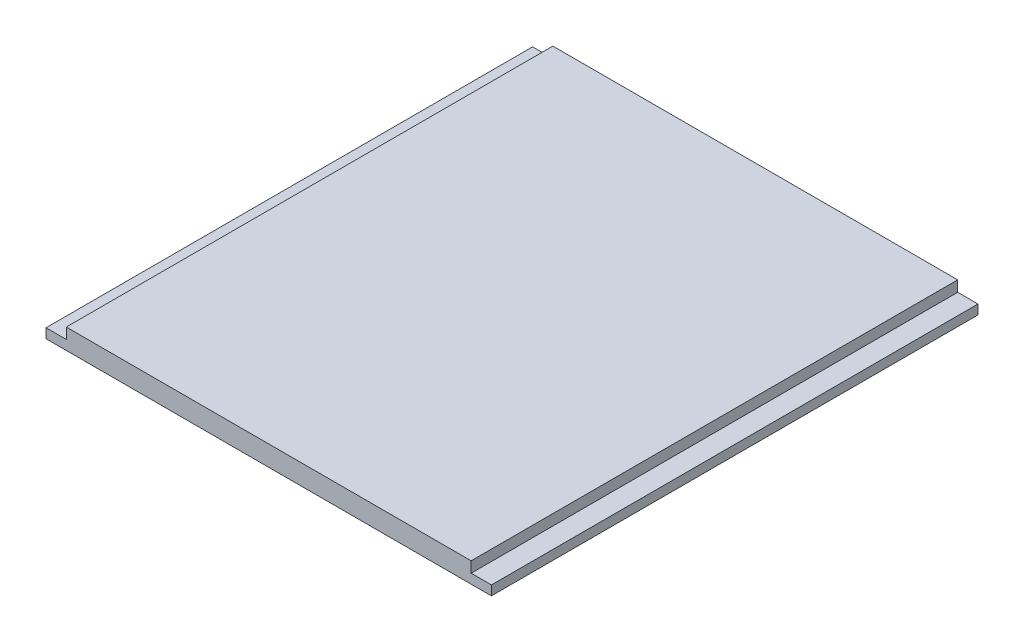
ISO-10303-21;
HEADER;
FILE_DESCRIPTION(('STEP AP214'),'2;1');
FILE_NAME('part.step','',(''),(''),'','','');
FILE_SCHEMA(('AUTOMOTIVE_DESIGN { 1 0 10303 214 1 1 1 1 }'));
ENDSEC;
DATA;
#1=APPLICATION_CONTEXT('core data for automotive mechanical design processes');
#2=APPLICATION_PROTOCOL_DEFINITION('international standard','automotive_design',2000,#1);
#3=PRODUCT_CONTEXT('',#1,'mechanical');
#4=PRODUCT('Part','Part','',(#3));
#5=PRODUCT_RELATED_PRODUCT_CATEGORY('part','',(#4));
#6=PRODUCT_DEFINITION_FORMATION('','',#4);
#7=PRODUCT_DEFINITION_CONTEXT('part definition',#1,'design');
#8=PRODUCT_DEFINITION('design','',#6,#7);
#9=PRODUCT_DEFINITION_SHAPE('','',#8);
#10=(LENGTH_UNIT() NAMED_UNIT(*) SI_UNIT(.MILLI.,.METRE.));
#11=(NAMED_UNIT(*) PLANE_ANGLE_UNIT() SI_UNIT($,.RADIAN.));
#12=(NAMED_UNIT(*) SI_UNIT($,.STERADIAN.) SOLID_ANGLE_UNIT());
#13=UNCERTAINTY_MEASURE_WITH_UNIT(LENGTH_MEASURE(1.E-05),#10,'distance_accuracy_value','');
#14=(GEOMETRIC_REPRESENTATION_CONTEXT(3) GLOBAL_UNCERTAINTY_ASSIGNED_CONTEXT((#13)) GLOBAL_UNIT_ASSIGNED_CONTEXT((#10,
#11,#12)) REPRESENTATION_CONTEXT('',''));
#15=CARTESIAN_POINT('',(0.,0.,0.));
#16=DIRECTION('',(0.,0.,1.));
#17=DIRECTION('',(1.,0.,0.));
#18=AXIS2_PLACEMENT_3D('',#15,#16,#17);
#19=CARTESIAN_POINT('',(0.,6.35,0.));
#20=DIRECTION('',(1.,0.,0.));
#21=DIRECTION('',(0.,0.,-1.));
#22=AXIS2_PLACEMENT_3D('',#19,#20,#21);
#23=PLANE('',#22);
#24=DIRECTION('',(0.,0.,1.));
#25=VECTOR('',#24,1.);
#26=CARTESIAN_POINT('',(0.,2.975,-152.4));
#27=LINE('',#26,#25);
#28=CARTESIAN_POINT('',(0.,2.975,-152.4));
#29=VERTEX_POINT('',#28);
#30=CARTESIAN_POINT('',(0.,2.975,0.));
#31=VERTEX_POINT('',#30);
#32=EDGE_CURVE('E97',#29,#31,#27,.T.);
#33=ORIENTED_EDGE('',*,*,#32,.F.);
#34=DIRECTION('',(0.,-1.,0.));
#35=VECTOR('',#34,1.);
#36=CARTESIAN_POINT('',(0.,6.35,-152.4));
#37=LINE('',#36,#35);
#38=CARTESIAN_POINT('',(0.,0.,-152.4));
#39=VERTEX_POINT('',#38);
#40=EDGE_CURVE('E119',#29,#39,#37,.T.);
#41=ORIENTED_EDGE('',*,*,#40,.T.);
#42=DIRECTION('',(0.,0.,1.));
#43=VECTOR('',#42,1.);
#44=CARTESIAN_POINT('',(0.,0.,0.));
#45=LINE('',#44,#43);
#46=CARTESIAN_POINT('',(0.,0.,0.));
#47=VERTEX_POINT('',#46);
#48=EDGE_CURVE('E118',#39,#47,#45,.T.);
#49=ORIENTED_EDGE('',*,*,#48,.T.);
#50=DIRECTION('',(0.,-1.,0.));
#51=VECTOR('',#50,1.);
#52=CARTESIAN_POINT('',(0.,6.35,0.));
#53=LINE('',#52,#51);
#54=EDGE_CURVE('E11',#31,#47,#53,.T.);
#55=ORIENTED_EDGE('',*,*,#54,.F.);
#56=EDGE_LOOP('',(#33,#41,#49,#55));
#57=FACE_BOUND('',#56,.T.);
#58=ADVANCED_FACE('F34',(#57),#23,.F.);
#59=CARTESIAN_POINT('',(0.,6.35,0.));
#60=DIRECTION('',(0.,0.,-1.));
#61=DIRECTION('',(-1.,0.,0.));
#62=AXIS2_PLACEMENT_3D('',#59,#60,#61);
#63=PLANE('',#62);
#64=DIRECTION('',(1.,0.,0.));
#65=VECTOR('',#64,1.);
#66=CARTESIAN_POINT('',(0.,6.35,0.));
#67=LINE('',#66,#65);
#68=CARTESIAN_POINT('',(6.35000000000002,6.35,0.));
#69=VERTEX_POINT('',#68);
#70=CARTESIAN_POINT('',(133.15,6.35,0.));
#71=VERTEX_POINT('',#70);
#72=EDGE_CURVE('E138',#69,#71,#67,.T.);
#73=ORIENTED_EDGE('',*,*,#72,.F.);
#74=DIRECTION('',(0.,1.,0.));
#75=VECTOR('',#74,1.);
#76=CARTESIAN_POINT('',(6.35000000000002,2.975,0.));
#77=LINE('',#76,#75);
#78=CARTESIAN_POINT('',(6.35000000000002,2.975,0.));
#79=VERTEX_POINT('',#78);
#80=EDGE_CURVE('E56',#79,#69,#77,.T.);
#81=ORIENTED_EDGE('',*,*,#80,.F.);
#82=DIRECTION('',(1.,0.,0.));
#83=VECTOR('',#82,1.);
#84=CARTESIAN_POINT('',(0.,2.975,0.));
#85=LINE('',#84,#83);
#86=EDGE_CURVE('E101',#31,#79,#85,.T.);
#87=ORIENTED_EDGE('',*,*,#86,.F.);
#88=ORIENTED_EDGE('',*,*,#54,.T.);
#89=DIRECTION('',(1.,0.,0.));
#90=VECTOR('',#89,1.);
#91=CARTESIAN_POINT('',(0.,0.,0.));
#92=LINE('',#91,#90);
#93=CARTESIAN_POINT('',(139.5,0.,0.));
#94=VERTEX_POINT('',#93);
#95=EDGE_CURVE('E123',#47,#94,#92,.T.);
#96=ORIENTED_EDGE('',*,*,#95,.T.);
#97=DIRECTION('',(0.,-1.,0.));
#98=VECTOR('',#97,1.);
#99=CARTESIAN_POINT('',(139.5,6.35,0.));
#100=LINE('',#99,#98);
#101=CARTESIAN_POINT('',(139.5,2.975,0.));
#102=VERTEX_POINT('',#101);
#103=EDGE_CURVE('E41',#102,#94,#100,.T.);
#104=ORIENTED_EDGE('',*,*,#103,.F.);
#105=DIRECTION('',(1.,0.,0.));
#106=VECTOR('',#105,1.);
#107=CARTESIAN_POINT('',(139.5,2.975,0.));
#108=LINE('',#107,#106);
#109=CARTESIAN_POINT('',(133.15,2.975,0.));
#110=VERTEX_POINT('',#109);
#111=EDGE_CURVE('E160',#110,#102,#108,.T.);
#112=ORIENTED_EDGE('',*,*,#111,.F.);
#113=DIRECTION('',(0.,1.,0.));
#114=VECTOR('',#113,1.);
#115=CARTESIAN_POINT('',(133.15,2.975,0.));
#116=LINE('',#115,#114);
#117=EDGE_CURVE('E168',#110,#71,#116,.T.);
#118=ORIENTED_EDGE('',*,*,#117,.T.);
#119=EDGE_LOOP('',(#73,#81,#87,#88,#96,#104,#112,#118));
#120=FACE_BOUND('',#119,.T.);
#121=ADVANCED_FACE('F111',(#120),#63,.F.);
#122=CARTESIAN_POINT('',(139.5,6.35,0.));
#123=DIRECTION('',(-1.,0.,0.));
#124=DIRECTION('',(0.,0.,1.));
#125=AXIS2_PLACEMENT_3D('',#122,#123,#124);
#126=PLANE('',#125);
#127=DIRECTION('',(0.,-1.,0.));
#128=VECTOR('',#127,1.);
#129=CARTESIAN_POINT('',(139.5,6.35,-152.4));
#130=LINE('',#129,#128);
#131=CARTESIAN_POINT('',(139.5,2.975,-152.4));
#132=VERTEX_POINT('',#131);
#133=CARTESIAN_POINT('',(139.5,0.,-152.4));
#134=VERTEX_POINT('',#133);
#135=EDGE_CURVE('E140',#132,#134,#130,.T.);
#136=ORIENTED_EDGE('',*,*,#135,.F.);
#137=DIRECTION('',(0.,0.,-1.));
#138=VECTOR('',#137,1.);
#139=CARTESIAN_POINT('',(139.5,2.975,-152.4));
#140=LINE('',#139,#138);
#141=EDGE_CURVE('E147',#102,#132,#140,.T.);
#142=ORIENTED_EDGE('',*,*,#141,.F.);
#143=ORIENTED_EDGE('',*,*,#103,.T.);
#144=DIRECTION('',(0.,0.,-1.));
#145=VECTOR('',#144,1.);
#146=CARTESIAN_POINT('',(139.5,0.,0.));
#147=LINE('',#146,#145);
#148=EDGE_CURVE('E126',#94,#134,#147,.T.);
#149=ORIENTED_EDGE('',*,*,#148,.T.);
#150=EDGE_LOOP('',(#136,#142,#143,#149));
#151=FACE_BOUND('',#150,.T.);
#152=ADVANCED_FACE('F145',(#151),#126,.F.);
#153=CARTESIAN_POINT('',(0.,6.35,-152.4));
#154=DIRECTION('',(0.,0.,1.));
#155=DIRECTION('',(1.,0.,0.));
#156=AXIS2_PLACEMENT_3D('',#153,#154,#155);
#157=PLANE('',#156);
#158=DIRECTION('',(-1.,0.,0.));
#159=VECTOR('',#158,1.);
#160=CARTESIAN_POINT('',(0.,2.975,-152.4));
#161=LINE('',#160,#159);
#162=CARTESIAN_POINT('',(6.35,2.975,-152.4));
#163=VERTEX_POINT('',#162);
#164=EDGE_CURVE('E103',#163,#29,#161,.T.);
#165=ORIENTED_EDGE('',*,*,#164,.F.);
#166=DIRECTION('',(0.,1.,0.));
#167=VECTOR('',#166,1.);
#168=CARTESIAN_POINT('',(6.35,2.975,-152.4));
#169=LINE('',#168,#167);
#170=CARTESIAN_POINT('',(6.35,6.35,-152.4));
#171=VERTEX_POINT('',#170);
#172=EDGE_CURVE('E124',#163,#171,#169,.T.);
#173=ORIENTED_EDGE('',*,*,#172,.T.);
#174=DIRECTION('',(-1.,0.,0.));
#175=VECTOR('',#174,1.);
#176=CARTESIAN_POINT('',(0.,6.35,-152.4));
#177=LINE('',#176,#175);
#178=CARTESIAN_POINT('',(133.15,6.35,-152.4));
#179=VERTEX_POINT('',#178);
#180=EDGE_CURVE('E131',#179,#171,#177,.T.);
#181=ORIENTED_EDGE('',*,*,#180,.F.);
#182=DIRECTION('',(0.,1.,0.));
#183=VECTOR('',#182,1.);
#184=CARTESIAN_POINT('',(133.15,2.975,-152.4));
#185=LINE('',#184,#183);
#186=CARTESIAN_POINT('',(133.15,2.975,-152.4));
#187=VERTEX_POINT('',#186);
#188=EDGE_CURVE('E48',#187,#179,#185,.T.);
#189=ORIENTED_EDGE('',*,*,#188,.F.);
#190=DIRECTION('',(-1.,0.,0.));
#191=VECTOR('',#190,1.);
#192=CARTESIAN_POINT('',(139.5,2.975,-152.4));
#193=LINE('',#192,#191);
#194=EDGE_CURVE('E154',#132,#187,#193,.T.);
#195=ORIENTED_EDGE('',*,*,#194,.F.);
#196=ORIENTED_EDGE('',*,*,#135,.T.);
#197=DIRECTION('',(-1.,0.,0.));
#198=VECTOR('',#197,1.);
#199=CARTESIAN_POINT('',(0.,0.,-152.4));
#200=LINE('',#199,#198);
#201=EDGE_CURVE('E136',#134,#39,#200,.T.);
#202=ORIENTED_EDGE('',*,*,#201,.T.);
#203=ORIENTED_EDGE('',*,*,#40,.F.);
#204=EDGE_LOOP('',(#165,#173,#181,#189,#195,#196,#202,#203));
#205=FACE_BOUND('',#204,.T.);
#206=ADVANCED_FACE('F151',(#205),#157,.F.);
#207=CARTESIAN_POINT('',(0.,6.35,0.));
#208=DIRECTION('',(0.,-1.,0.));
#209=DIRECTION('',(0.,0.,-1.));
#210=AXIS2_PLACEMENT_3D('',#207,#208,#209);
#211=PLANE('',#210);
#212=ORIENTED_EDGE('',*,*,#180,.T.);
#213=DIRECTION('',(0.,0.,-1.));
#214=VECTOR('',#213,1.);
#215=CARTESIAN_POINT('',(6.35,6.35,-152.4));
#216=LINE('',#215,#214);
#217=EDGE_CURVE('E107',#69,#171,#216,.T.);
#218=ORIENTED_EDGE('',*,*,#217,.F.);
#219=ORIENTED_EDGE('',*,*,#72,.T.);
#220=DIRECTION('',(0.,0.,1.));
#221=VECTOR('',#220,1.);
#222=CARTESIAN_POINT('',(133.15,6.35,-152.4));
#223=LINE('',#222,#221);
#224=EDGE_CURVE('E162',#179,#71,#223,.T.);
#225=ORIENTED_EDGE('',*,*,#224,.F.);
#226=EDGE_LOOP('',(#212,#218,#219,#225));
#227=FACE_BOUND('',#226,.T.);
#228=ADVANCED_FACE('F174',(#227),#211,.F.);
#229=CARTESIAN_POINT('',(0.,0.,0.));
#230=DIRECTION('',(0.,-1.,0.));
#231=DIRECTION('',(0.,0.,-1.));
#232=AXIS2_PLACEMENT_3D('',#229,#230,#231);
#233=PLANE('',#232);
#234=ORIENTED_EDGE('',*,*,#48,.F.);
#235=ORIENTED_EDGE('',*,*,#201,.F.);
#236=ORIENTED_EDGE('',*,*,#148,.F.);
#237=ORIENTED_EDGE('',*,*,#95,.F.);
#238=EDGE_LOOP('',(#234,#235,#236,#237));
#239=FACE_BOUND('',#238,.T.);
#240=ADVANCED_FACE('F149',(#239),#233,.T.);
#241=CARTESIAN_POINT('',(133.15,2.975,-152.4));
#242=DIRECTION('',(-1.,0.,0.));
#243=DIRECTION('',(0.,0.,1.));
#244=AXIS2_PLACEMENT_3D('',#241,#242,#243);
#245=PLANE('',#244);
#246=ORIENTED_EDGE('',*,*,#224,.T.);
#247=ORIENTED_EDGE('',*,*,#117,.F.);
#248=DIRECTION('',(0.,0.,1.));
#249=VECTOR('',#248,1.);
#250=CARTESIAN_POINT('',(133.15,2.975,-152.4));
#251=LINE('',#250,#249);
#252=EDGE_CURVE('E158',#187,#110,#251,.T.);
#253=ORIENTED_EDGE('',*,*,#252,.F.);
#254=ORIENTED_EDGE('',*,*,#188,.T.);
#255=EDGE_LOOP('',(#246,#247,#253,#254));
#256=FACE_BOUND('',#255,.T.);
#257=ADVANCED_FACE('F187',(#256),#245,.F.);
#258=CARTESIAN_POINT('',(0.,2.975,0.));
#259=DIRECTION('',(0.,-1.,0.));
#260=DIRECTION('',(0.,0.,-1.));
#261=AXIS2_PLACEMENT_3D('',#258,#259,#260);
#262=PLANE('',#261);
#263=ORIENTED_EDGE('',*,*,#141,.T.);
#264=ORIENTED_EDGE('',*,*,#194,.T.);
#265=ORIENTED_EDGE('',*,*,#252,.T.);
#266=ORIENTED_EDGE('',*,*,#111,.T.);
#267=EDGE_LOOP('',(#263,#264,#265,#266));
#268=FACE_BOUND('',#267,.T.);
#269=ADVANCED_FACE('F180',(#268),#262,.F.);
#270=CARTESIAN_POINT('',(6.35,2.975,-152.4));
#271=DIRECTION('',(1.,0.,0.));
#272=DIRECTION('',(0.,0.,-1.));
#273=AXIS2_PLACEMENT_3D('',#270,#271,#272);
#274=PLANE('',#273);
#275=ORIENTED_EDGE('',*,*,#217,.T.);
#276=ORIENTED_EDGE('',*,*,#172,.F.);
#277=DIRECTION('',(0.,0.,-1.));
#278=VECTOR('',#277,1.);
#279=CARTESIAN_POINT('',(6.35,2.975,-152.4));
#280=LINE('',#279,#278);
#281=EDGE_CURVE('E114',#79,#163,#280,.T.);
#282=ORIENTED_EDGE('',*,*,#281,.F.);
#283=ORIENTED_EDGE('',*,*,#80,.T.);
#284=EDGE_LOOP('',(#275,#276,#282,#283));
#285=FACE_BOUND('',#284,.T.);
#286=ADVANCED_FACE('F175',(#285),#274,.F.);
#287=CARTESIAN_POINT('',(0.,2.975,0.));
#288=DIRECTION('',(0.,1.,0.));
#289=DIRECTION('',(0.,0.,1.));
#290=AXIS2_PLACEMENT_3D('',#287,#288,#289);
#291=PLANE('',#290);
#292=ORIENTED_EDGE('',*,*,#32,.T.);
#293=ORIENTED_EDGE('',*,*,#86,.T.);
#294=ORIENTED_EDGE('',*,*,#281,.T.);
#295=ORIENTED_EDGE('',*,*,#164,.T.);
#296=EDGE_LOOP('',(#292,#293,#294,#295));
#297=FACE_BOUND('',#296,.T.);
#298=ADVANCED_FACE('F99',(#297),#291,.T.);
#299=CLOSED_SHELL('',(#58,#121,#152,#206,#228,#240,#257,#269,#286,#298));
#300=MANIFOLD_SOLID_BREP('B2',#299);
#301=ADVANCED_BREP_SHAPE_REPRESENTATION('',(#18,#300),#14);
#302=SHAPE_DEFINITION_REPRESENTATION(#9,#301);
ENDSEC;
END-ISO-10303-21;
